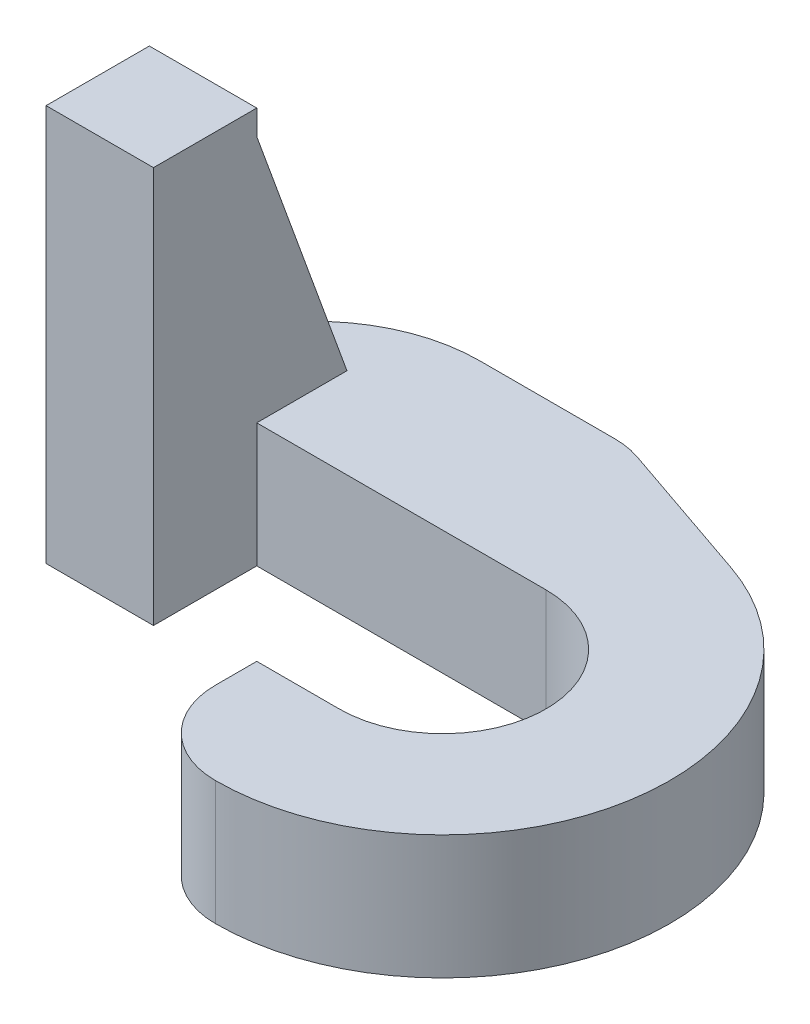
ISO-10303-21;
HEADER;
FILE_DESCRIPTION(('STEP AP214'),'2;1');
FILE_NAME('part.step','',(''),(''),'','','');
FILE_SCHEMA(('AUTOMOTIVE_DESIGN { 1 0 10303 214 1 1 1 1 }'));
ENDSEC;
DATA;
#1=APPLICATION_CONTEXT('core data for automotive mechanical design processes');
#2=APPLICATION_PROTOCOL_DEFINITION('international standard','automotive_design',2000,#1);
#3=PRODUCT_CONTEXT('',#1,'mechanical');
#4=PRODUCT('Part','Part','',(#3));
#5=PRODUCT_RELATED_PRODUCT_CATEGORY('part','',(#4));
#6=PRODUCT_DEFINITION_FORMATION('','',#4);
#7=PRODUCT_DEFINITION_CONTEXT('part definition',#1,'design');
#8=PRODUCT_DEFINITION('design','',#6,#7);
#9=PRODUCT_DEFINITION_SHAPE('','',#8);
#10=(LENGTH_UNIT() NAMED_UNIT(*) SI_UNIT(.MILLI.,.METRE.));
#11=(NAMED_UNIT(*) PLANE_ANGLE_UNIT() SI_UNIT($,.RADIAN.));
#12=(NAMED_UNIT(*) SI_UNIT($,.STERADIAN.) SOLID_ANGLE_UNIT());
#13=UNCERTAINTY_MEASURE_WITH_UNIT(LENGTH_MEASURE(1.E-05),#10,'distance_accuracy_value','');
#14=(GEOMETRIC_REPRESENTATION_CONTEXT(3) GLOBAL_UNCERTAINTY_ASSIGNED_CONTEXT((#13)) GLOBAL_UNIT_ASSIGNED_CONTEXT((#10,
#11,#12)) REPRESENTATION_CONTEXT('',''));
#15=CARTESIAN_POINT('',(0.,0.,0.));
#16=DIRECTION('',(0.,0.,1.));
#17=DIRECTION('',(1.,0.,0.));
#18=AXIS2_PLACEMENT_3D('',#15,#16,#17);
#19=CARTESIAN_POINT('',(9.6,0.,3.5));
#20=DIRECTION('',(0.,1.,0.));
#21=DIRECTION('',(0.,0.,-1.));
#22=AXIS2_PLACEMENT_3D('',#19,#20,#21);
#23=CYLINDRICAL_SURFACE('',#22,2.);
#24=CARTESIAN_POINT('',(9.6,0.,3.5));
#25=DIRECTION('',(0.,1.,0.));
#26=DIRECTION('',(0.,0.,-1.));
#27=AXIS2_PLACEMENT_3D('',#24,#25,#26);
#28=CIRCLE('',#27,2.);
#29=CARTESIAN_POINT('',(7.6,0.,3.5));
#30=VERTEX_POINT('',#29);
#31=CARTESIAN_POINT('',(9.6,0.,5.5));
#32=VERTEX_POINT('',#31);
#33=EDGE_CURVE('E200',#30,#32,#28,.T.);
#34=ORIENTED_EDGE('',*,*,#33,.T.);
#35=DIRECTION('',(0.,1.,0.));
#36=VECTOR('',#35,1.);
#37=CARTESIAN_POINT('',(9.6,0.,5.5));
#38=LINE('',#37,#36);
#39=CARTESIAN_POINT('',(9.6,3.,5.5));
#40=VERTEX_POINT('',#39);
#41=EDGE_CURVE('E92',#32,#40,#38,.T.);
#42=ORIENTED_EDGE('',*,*,#41,.T.);
#43=CARTESIAN_POINT('',(9.6,3.,3.5));
#44=DIRECTION('',(0.,-1.,0.));
#45=DIRECTION('',(0.,0.,1.));
#46=AXIS2_PLACEMENT_3D('',#43,#44,#45);
#47=CIRCLE('',#46,2.);
#48=CARTESIAN_POINT('',(7.6,3.,3.5));
#49=VERTEX_POINT('',#48);
#50=EDGE_CURVE('E271',#40,#49,#47,.T.);
#51=ORIENTED_EDGE('',*,*,#50,.T.);
#52=DIRECTION('',(0.,-1.,0.));
#53=VECTOR('',#52,1.);
#54=CARTESIAN_POINT('',(7.6,0.,3.5));
#55=LINE('',#54,#53);
#56=EDGE_CURVE('E9',#49,#30,#55,.T.);
#57=ORIENTED_EDGE('',*,*,#56,.T.);
#58=EDGE_LOOP('',(#34,#42,#51,#57));
#59=FACE_BOUND('',#58,.T.);
#60=ADVANCED_FACE('F14',(#59),#23,.T.);
#61=CARTESIAN_POINT('',(7.26666666666666,0.,-4.5));
#62=DIRECTION('',(0.,1.,0.));
#63=DIRECTION('',(0.,0.,-1.));
#64=AXIS2_PLACEMENT_3D('',#61,#62,#63);
#65=CYLINDRICAL_SURFACE('',#64,2.);
#66=CARTESIAN_POINT('',(7.26666666666666,0.,-4.5));
#67=DIRECTION('',(0.,1.,0.));
#68=DIRECTION('',(0.,0.,-1.));
#69=AXIS2_PLACEMENT_3D('',#66,#67,#68);
#70=CIRCLE('',#69,2.);
#71=CARTESIAN_POINT('',(7.91531531531532,0.,-6.39189189189189));
#72=VERTEX_POINT('',#71);
#73=CARTESIAN_POINT('',(7.26666666666666,0.,-6.5));
#74=VERTEX_POINT('',#73);
#75=EDGE_CURVE('E214',#72,#74,#70,.T.);
#76=ORIENTED_EDGE('',*,*,#75,.T.);
#77=DIRECTION('',(0.,1.,0.));
#78=VECTOR('',#77,1.);
#79=CARTESIAN_POINT('',(7.26666666666666,0.,-6.5));
#80=LINE('',#79,#78);
#81=CARTESIAN_POINT('',(7.26666666666666,3.,-6.5));
#82=VERTEX_POINT('',#81);
#83=EDGE_CURVE('E300',#74,#82,#80,.T.);
#84=ORIENTED_EDGE('',*,*,#83,.T.);
#85=CARTESIAN_POINT('',(7.26666666666666,3.,-4.5));
#86=DIRECTION('',(0.,-1.,0.));
#87=DIRECTION('',(0.,0.,1.));
#88=AXIS2_PLACEMENT_3D('',#85,#86,#87);
#89=CIRCLE('',#88,2.);
#90=CARTESIAN_POINT('',(7.91531531531532,3.,-6.39189189189189));
#91=VERTEX_POINT('',#90);
#92=EDGE_CURVE('E293',#82,#91,#89,.T.);
#93=ORIENTED_EDGE('',*,*,#92,.T.);
#94=DIRECTION('',(0.,-1.,0.));
#95=VECTOR('',#94,1.);
#96=CARTESIAN_POINT('',(7.91531531531532,0.,-6.39189189189189));
#97=LINE('',#96,#95);
#98=EDGE_CURVE('E40',#91,#72,#97,.T.);
#99=ORIENTED_EDGE('',*,*,#98,.T.);
#100=EDGE_LOOP('',(#76,#84,#93,#99));
#101=FACE_BOUND('',#100,.T.);
#102=ADVANCED_FACE('F527',(#101),#65,.T.);
#103=CARTESIAN_POINT('',(7.6,0.,0.));
#104=DIRECTION('',(1.,0.,0.));
#105=DIRECTION('',(0.,0.,1.));
#106=AXIS2_PLACEMENT_3D('',#103,#104,#105);
#107=PLANE('',#106);
#108=DIRECTION('',(0.,0.,1.));
#109=VECTOR('',#108,1.);
#110=CARTESIAN_POINT('',(7.6,3.,0.));
#111=LINE('',#110,#109);
#112=CARTESIAN_POINT('',(7.6,3.,2.5));
#113=VERTEX_POINT('',#112);
#114=EDGE_CURVE('E185',#113,#49,#111,.T.);
#115=ORIENTED_EDGE('',*,*,#114,.F.);
#116=DIRECTION('',(0.,1.,0.));
#117=VECTOR('',#116,1.);
#118=CARTESIAN_POINT('',(7.6,0.,2.5));
#119=LINE('',#118,#117);
#120=CARTESIAN_POINT('',(7.6,0.,2.5));
#121=VERTEX_POINT('',#120);
#122=EDGE_CURVE('E25',#121,#113,#119,.T.);
#123=ORIENTED_EDGE('',*,*,#122,.F.);
#124=DIRECTION('',(0.,0.,1.));
#125=VECTOR('',#124,1.);
#126=CARTESIAN_POINT('',(7.6,0.,0.));
#127=LINE('',#126,#125);
#128=EDGE_CURVE('E182',#121,#30,#127,.T.);
#129=ORIENTED_EDGE('',*,*,#128,.T.);
#130=ORIENTED_EDGE('',*,*,#56,.F.);
#131=EDGE_LOOP('',(#115,#123,#129,#130));
#132=FACE_BOUND('',#131,.T.);
#133=ADVANCED_FACE('F180',(#132),#107,.F.);
#134=CARTESIAN_POINT('',(0.,0.,2.5));
#135=DIRECTION('',(0.,0.,1.));
#136=DIRECTION('',(1.,0.,0.));
#137=AXIS2_PLACEMENT_3D('',#134,#135,#136);
#138=PLANE('',#137);
#139=DIRECTION('',(-1.,0.,0.));
#140=VECTOR('',#139,1.);
#141=CARTESIAN_POINT('',(0.,3.,2.5));
#142=LINE('',#141,#140);
#143=CARTESIAN_POINT('',(9.6,3.,2.5));
#144=VERTEX_POINT('',#143);
#145=EDGE_CURVE('E240',#144,#113,#142,.T.);
#146=ORIENTED_EDGE('',*,*,#145,.F.);
#147=DIRECTION('',(0.,1.,0.));
#148=VECTOR('',#147,1.);
#149=CARTESIAN_POINT('',(9.6,0.,2.5));
#150=LINE('',#149,#148);
#151=CARTESIAN_POINT('',(9.6,0.,2.5));
#152=VERTEX_POINT('',#151);
#153=EDGE_CURVE('E172',#152,#144,#150,.T.);
#154=ORIENTED_EDGE('',*,*,#153,.F.);
#155=DIRECTION('',(-1.,0.,0.));
#156=VECTOR('',#155,1.);
#157=CARTESIAN_POINT('',(0.,0.,2.5));
#158=LINE('',#157,#156);
#159=EDGE_CURVE('E190',#152,#121,#158,.T.);
#160=ORIENTED_EDGE('',*,*,#159,.T.);
#161=ORIENTED_EDGE('',*,*,#122,.T.);
#162=EDGE_LOOP('',(#146,#154,#160,#161));
#163=FACE_BOUND('',#162,.T.);
#164=ADVANCED_FACE('F191',(#163),#138,.F.);
#165=CARTESIAN_POINT('',(9.6,0.,0.));
#166=DIRECTION('',(0.,1.,0.));
#167=DIRECTION('',(0.,0.,-1.));
#168=AXIS2_PLACEMENT_3D('',#165,#166,#167);
#169=CYLINDRICAL_SURFACE('',#168,2.5);
#170=CARTESIAN_POINT('',(9.6,3.,0.));
#171=DIRECTION('',(0.,-1.,0.));
#172=DIRECTION('',(0.,0.,-1.));
#173=AXIS2_PLACEMENT_3D('',#170,#171,#172);
#174=CIRCLE('',#173,2.5);
#175=CARTESIAN_POINT('',(9.6,3.,-2.5));
#176=VERTEX_POINT('',#175);
#177=EDGE_CURVE('E230',#176,#144,#174,.T.);
#178=ORIENTED_EDGE('',*,*,#177,.F.);
#179=DIRECTION('',(0.,1.,0.));
#180=VECTOR('',#179,1.);
#181=CARTESIAN_POINT('',(9.6,0.,-2.5));
#182=LINE('',#181,#180);
#183=CARTESIAN_POINT('',(9.6,0.,-2.5));
#184=VERTEX_POINT('',#183);
#185=EDGE_CURVE('E164',#184,#176,#182,.T.);
#186=ORIENTED_EDGE('',*,*,#185,.F.);
#187=CARTESIAN_POINT('',(9.6,0.,0.));
#188=DIRECTION('',(0.,-1.,0.));
#189=DIRECTION('',(0.,0.,-1.));
#190=AXIS2_PLACEMENT_3D('',#187,#188,#189);
#191=CIRCLE('',#190,2.5);
#192=EDGE_CURVE('E195',#184,#152,#191,.T.);
#193=ORIENTED_EDGE('',*,*,#192,.T.);
#194=ORIENTED_EDGE('',*,*,#153,.T.);
#195=EDGE_LOOP('',(#178,#186,#193,#194));
#196=FACE_BOUND('',#195,.T.);
#197=ADVANCED_FACE('F16',(#196),#169,.F.);
#198=CARTESIAN_POINT('',(2.79357195032871,0.,-8.14791818845873));
#199=DIRECTION('',(0.324324324324324,0.,-0.945945945945946));
#200=DIRECTION('',(0.,-1.,0.));
#201=AXIS2_PLACEMENT_3D('',#198,#199,#200);
#202=PLANE('',#201);
#203=DIRECTION('',(0.945945945945946,0.,0.324324324324324));
#204=VECTOR('',#203,1.);
#205=CARTESIAN_POINT('',(2.79357195032871,3.,-8.14791818845873));
#206=LINE('',#205,#204);
#207=CARTESIAN_POINT('',(11.3837837837838,3.,-5.2027027027027));
#208=VERTEX_POINT('',#207);
#209=EDGE_CURVE('E270',#91,#208,#206,.T.);
#210=ORIENTED_EDGE('',*,*,#209,.T.);
#211=DIRECTION('',(0.,1.,0.));
#212=VECTOR('',#211,1.);
#213=CARTESIAN_POINT('',(11.3837837837838,0.,-5.2027027027027));
#214=LINE('',#213,#212);
#215=CARTESIAN_POINT('',(11.3837837837838,0.,-5.2027027027027));
#216=VERTEX_POINT('',#215);
#217=EDGE_CURVE('E104',#216,#208,#214,.T.);
#218=ORIENTED_EDGE('',*,*,#217,.F.);
#219=DIRECTION('',(0.945945945945946,0.,0.324324324324324));
#220=VECTOR('',#219,1.);
#221=CARTESIAN_POINT('',(2.79357195032871,0.,-8.14791818845873));
#222=LINE('',#221,#220);
#223=EDGE_CURVE('E280',#72,#216,#222,.T.);
#224=ORIENTED_EDGE('',*,*,#223,.F.);
#225=ORIENTED_EDGE('',*,*,#98,.F.);
#226=EDGE_LOOP('',(#210,#218,#224,#225));
#227=FACE_BOUND('',#226,.T.);
#228=ADVANCED_FACE('F512',(#227),#202,.T.);
#229=CARTESIAN_POINT('',(9.6,0.,0.));
#230=DIRECTION('',(0.,1.,0.));
#231=DIRECTION('',(0.,0.,-1.));
#232=AXIS2_PLACEMENT_3D('',#229,#230,#231);
#233=CYLINDRICAL_SURFACE('',#232,5.5);
#234=CARTESIAN_POINT('',(9.6,3.,0.));
#235=DIRECTION('',(0.,-1.,0.));
#236=DIRECTION('',(0.,0.,-1.));
#237=AXIS2_PLACEMENT_3D('',#234,#235,#236);
#238=CIRCLE('',#237,5.5);
#239=EDGE_CURVE('E268',#208,#40,#238,.T.);
#240=ORIENTED_EDGE('',*,*,#239,.T.);
#241=ORIENTED_EDGE('',*,*,#41,.F.);
#242=CARTESIAN_POINT('',(9.6,0.,0.));
#243=DIRECTION('',(0.,-1.,0.));
#244=DIRECTION('',(0.,0.,-1.));
#245=AXIS2_PLACEMENT_3D('',#242,#243,#244);
#246=CIRCLE('',#245,5.5);
#247=EDGE_CURVE('E208',#216,#32,#246,.T.);
#248=ORIENTED_EDGE('',*,*,#247,.F.);
#249=ORIENTED_EDGE('',*,*,#217,.T.);
#250=EDGE_LOOP('',(#240,#241,#248,#249));
#251=FACE_BOUND('',#250,.T.);
#252=ADVANCED_FACE('F516',(#251),#233,.T.);
#253=CARTESIAN_POINT('',(4.,0.,-2.5));
#254=DIRECTION('',(0.,1.,0.));
#255=DIRECTION('',(0.,0.,-1.));
#256=AXIS2_PLACEMENT_3D('',#253,#254,#255);
#257=CYLINDRICAL_SURFACE('',#256,4.);
#258=CARTESIAN_POINT('',(0.,9.,-2.5));
#259=CARTESIAN_POINT('',(0.,6.85439242775356,-3.28093729071387));
#260=CARTESIAN_POINT('',(0.222386019238584,4.79762064602606,-4.02954099794134));
#261=CARTESIAN_POINT('',(0.648742912211093,3.,-4.68382140559722));
#262=(BOUNDED_CURVE() B_SPLINE_CURVE(3,(#258,#259,#260,#261),.UNSPECIFIED.,.F.,
.F.) B_SPLINE_CURVE_WITH_KNOTS((4,4),(1.5707963267949,2.14832530863416),
.UNSPECIFIED.) CURVE() GEOMETRIC_REPRESENTATION_ITEM() RATIONAL_B_SPLINE_CURVE((1.,
0.972397627081488,0.972397627081488,1.)) REPRESENTATION_ITEM(''));
#263=CARTESIAN_POINT('',(0.,9.,-2.5));
#264=VERTEX_POINT('',#263);
#265=CARTESIAN_POINT('',(0.648742912211093,3.,-4.68382140559722));
#266=VERTEX_POINT('',#265);
#267=EDGE_CURVE('E221',#264,#266,#262,.T.);
#268=ORIENTED_EDGE('',*,*,#267,.T.);
#269=CARTESIAN_POINT('',(4.,3.,-2.5));
#270=DIRECTION('',(0.,-1.,0.));
#271=DIRECTION('',(0.,0.,1.));
#272=AXIS2_PLACEMENT_3D('',#269,#270,#271);
#273=CIRCLE('',#272,4.);
#274=CARTESIAN_POINT('',(4.,3.,-6.5));
#275=VERTEX_POINT('',#274);
#276=EDGE_CURVE('E231',#266,#275,#273,.T.);
#277=ORIENTED_EDGE('',*,*,#276,.T.);
#278=DIRECTION('',(0.,-1.,0.));
#279=VECTOR('',#278,1.);
#280=CARTESIAN_POINT('',(4.,0.,-6.5));
#281=LINE('',#280,#279);
#282=CARTESIAN_POINT('',(4.,0.,-6.5));
#283=VERTEX_POINT('',#282);
#284=EDGE_CURVE('E296',#275,#283,#281,.T.);
#285=ORIENTED_EDGE('',*,*,#284,.T.);
#286=CARTESIAN_POINT('',(4.,0.,-2.5));
#287=DIRECTION('',(0.,1.,0.));
#288=DIRECTION('',(0.,0.,-1.));
#289=AXIS2_PLACEMENT_3D('',#286,#287,#288);
#290=CIRCLE('',#289,4.);
#291=CARTESIAN_POINT('',(0.,0.,-2.5));
#292=VERTEX_POINT('',#291);
#293=EDGE_CURVE('E286',#283,#292,#290,.T.);
#294=ORIENTED_EDGE('',*,*,#293,.T.);
#295=DIRECTION('',(0.,1.,0.));
#296=VECTOR('',#295,1.);
#297=CARTESIAN_POINT('',(0.,3.,-2.5));
#298=LINE('',#297,#296);
#299=EDGE_CURVE('E308',#292,#264,#298,.T.);
#300=ORIENTED_EDGE('',*,*,#299,.T.);
#301=EDGE_LOOP('',(#268,#277,#285,#294,#300));
#302=FACE_BOUND('',#301,.T.);
#303=ADVANCED_FACE('F503',(#302),#257,.T.);
#304=CARTESIAN_POINT('',(0.,3.,-4.68382140559722));
#305=DIRECTION('',(0.,0.342020143325672,-0.939692620785907));
#306=DIRECTION('',(-1.,0.,0.));
#307=AXIS2_PLACEMENT_3D('',#304,#305,#306);
#308=PLANE('',#307);
#309=DIRECTION('',(1.,0.,0.));
#310=VECTOR('',#309,1.);
#311=CARTESIAN_POINT('',(2.6,9.,-2.5));
#312=LINE('',#311,#310);
#313=CARTESIAN_POINT('',(2.6,9.,-2.5));
#314=VERTEX_POINT('',#313);
#315=EDGE_CURVE('E291',#264,#314,#312,.T.);
#316=ORIENTED_EDGE('',*,*,#315,.T.);
#317=DIRECTION('',(0.,-0.939692620785907,-0.342020143325672));
#318=VECTOR('',#317,1.);
#319=CARTESIAN_POINT('',(2.6,1.05280000596461,-5.39254424358944));
#320=LINE('',#319,#318);
#321=CARTESIAN_POINT('',(2.6,3.,-4.68382140559722));
#322=VERTEX_POINT('',#321);
#323=EDGE_CURVE('E267',#314,#322,#320,.T.);
#324=ORIENTED_EDGE('',*,*,#323,.T.);
#325=DIRECTION('',(-1.,0.,0.));
#326=VECTOR('',#325,1.);
#327=CARTESIAN_POINT('',(0.,3.,-4.68382140559722));
#328=LINE('',#327,#326);
#329=EDGE_CURVE('E227',#322,#266,#328,.T.);
#330=ORIENTED_EDGE('',*,*,#329,.T.);
#331=ORIENTED_EDGE('',*,*,#267,.F.);
#332=EDGE_LOOP('',(#316,#324,#330,#331));
#333=FACE_BOUND('',#332,.T.);
#334=ADVANCED_FACE('F502',(#333),#308,.T.);
#335=CARTESIAN_POINT('',(0.,0.,-6.5));
#336=DIRECTION('',(0.,0.,-1.));
#337=DIRECTION('',(0.,-1.,0.));
#338=AXIS2_PLACEMENT_3D('',#335,#336,#337);
#339=PLANE('',#338);
#340=DIRECTION('',(1.,0.,0.));
#341=VECTOR('',#340,1.);
#342=CARTESIAN_POINT('',(0.,0.,-6.5));
#343=LINE('',#342,#341);
#344=EDGE_CURVE('E218',#283,#74,#343,.T.);
#345=ORIENTED_EDGE('',*,*,#344,.F.);
#346=ORIENTED_EDGE('',*,*,#284,.F.);
#347=DIRECTION('',(-1.,0.,0.));
#348=VECTOR('',#347,1.);
#349=CARTESIAN_POINT('',(0.,3.,-6.5));
#350=LINE('',#349,#348);
#351=EDGE_CURVE('E244',#82,#275,#350,.T.);
#352=ORIENTED_EDGE('',*,*,#351,.F.);
#353=ORIENTED_EDGE('',*,*,#83,.F.);
#354=EDGE_LOOP('',(#345,#346,#352,#353));
#355=FACE_BOUND('',#354,.T.);
#356=ADVANCED_FACE('F509',(#355),#339,.T.);
#357=CARTESIAN_POINT('',(0.,3.,-6.5));
#358=DIRECTION('',(0.,-1.,0.));
#359=DIRECTION('',(0.,0.,-1.));
#360=AXIS2_PLACEMENT_3D('',#357,#358,#359);
#361=PLANE('',#360);
#362=ORIENTED_EDGE('',*,*,#351,.T.);
#363=ORIENTED_EDGE('',*,*,#276,.F.);
#364=ORIENTED_EDGE('',*,*,#329,.F.);
#365=DIRECTION('',(0.,0.,-1.));
#366=VECTOR('',#365,1.);
#367=CARTESIAN_POINT('',(2.6,3.,-2.5));
#368=LINE('',#367,#366);
#369=CARTESIAN_POINT('',(2.6,3.,-2.5));
#370=VERTEX_POINT('',#369);
#371=EDGE_CURVE('E263',#370,#322,#368,.T.);
#372=ORIENTED_EDGE('',*,*,#371,.F.);
#373=DIRECTION('',(-1.,0.,0.));
#374=VECTOR('',#373,1.);
#375=CARTESIAN_POINT('',(0.,3.,-2.5));
#376=LINE('',#375,#374);
#377=EDGE_CURVE('E253',#176,#370,#376,.T.);
#378=ORIENTED_EDGE('',*,*,#377,.F.);
#379=ORIENTED_EDGE('',*,*,#177,.T.);
#380=ORIENTED_EDGE('',*,*,#145,.T.);
#381=ORIENTED_EDGE('',*,*,#114,.T.);
#382=ORIENTED_EDGE('',*,*,#50,.F.);
#383=ORIENTED_EDGE('',*,*,#239,.F.);
#384=ORIENTED_EDGE('',*,*,#209,.F.);
#385=ORIENTED_EDGE('',*,*,#92,.F.);
#386=EDGE_LOOP('',(#362,#363,#364,#372,#378,#379,#380,#381,#382,#383,#384,#385));
#387=FACE_BOUND('',#386,.T.);
#388=ADVANCED_FACE('F539',(#387),#361,.F.);
#389=CARTESIAN_POINT('',(0.,0.,-2.5));
#390=DIRECTION('',(0.,0.,-1.));
#391=DIRECTION('',(0.,-1.,0.));
#392=AXIS2_PLACEMENT_3D('',#389,#390,#391);
#393=PLANE('',#392);
#394=DIRECTION('',(1.,0.,0.));
#395=VECTOR('',#394,1.);
#396=CARTESIAN_POINT('',(0.,0.,-2.5));
#397=LINE('',#396,#395);
#398=CARTESIAN_POINT('',(2.6,0.,-2.5));
#399=VERTEX_POINT('',#398);
#400=EDGE_CURVE('E224',#399,#184,#397,.T.);
#401=ORIENTED_EDGE('',*,*,#400,.T.);
#402=ORIENTED_EDGE('',*,*,#185,.T.);
#403=ORIENTED_EDGE('',*,*,#377,.T.);
#404=DIRECTION('',(0.,1.,0.));
#405=VECTOR('',#404,1.);
#406=CARTESIAN_POINT('',(2.6,0.,-2.5));
#407=LINE('',#406,#405);
#408=EDGE_CURVE('E212',#399,#370,#407,.T.);
#409=ORIENTED_EDGE('',*,*,#408,.F.);
#410=EDGE_LOOP('',(#401,#402,#403,#409));
#411=FACE_BOUND('',#410,.T.);
#412=ADVANCED_FACE('F536',(#411),#393,.F.);
#413=CARTESIAN_POINT('',(0.,0.,0.));
#414=DIRECTION('',(0.,0.,1.));
#415=DIRECTION('',(1.,0.,0.));
#416=AXIS2_PLACEMENT_3D('',#413,#414,#415);
#417=PLANE('',#416);
#418=DIRECTION('',(0.,-1.,0.));
#419=VECTOR('',#418,1.);
#420=CARTESIAN_POINT('',(0.,0.,0.));
#421=LINE('',#420,#419);
#422=CARTESIAN_POINT('',(0.,9.6,0.));
#423=VERTEX_POINT('',#422);
#424=CARTESIAN_POINT('',(0.,0.,0.));
#425=VERTEX_POINT('',#424);
#426=EDGE_CURVE('E341',#423,#425,#421,.T.);
#427=ORIENTED_EDGE('',*,*,#426,.T.);
#428=DIRECTION('',(1.,0.,0.));
#429=VECTOR('',#428,1.);
#430=CARTESIAN_POINT('',(0.,0.,0.));
#431=LINE('',#430,#429);
#432=CARTESIAN_POINT('',(2.6,0.,0.));
#433=VERTEX_POINT('',#432);
#434=EDGE_CURVE('E262',#425,#433,#431,.T.);
#435=ORIENTED_EDGE('',*,*,#434,.T.);
#436=DIRECTION('',(0.,1.,0.));
#437=VECTOR('',#436,1.);
#438=CARTESIAN_POINT('',(2.6,0.,0.));
#439=LINE('',#438,#437);
#440=CARTESIAN_POINT('',(2.6,9.6,0.));
#441=VERTEX_POINT('',#440);
#442=EDGE_CURVE('E217',#433,#441,#439,.T.);
#443=ORIENTED_EDGE('',*,*,#442,.T.);
#444=DIRECTION('',(-1.,0.,0.));
#445=VECTOR('',#444,1.);
#446=CARTESIAN_POINT('',(0.,9.6,0.));
#447=LINE('',#446,#445);
#448=EDGE_CURVE('E18',#441,#423,#447,.T.);
#449=ORIENTED_EDGE('',*,*,#448,.T.);
#450=EDGE_LOOP('',(#427,#435,#443,#449));
#451=FACE_BOUND('',#450,.T.);
#452=ADVANCED_FACE('F355',(#451),#417,.T.);
#453=CARTESIAN_POINT('',(0.,9.6,-2.5));
#454=DIRECTION('',(0.,-1.,0.));
#455=DIRECTION('',(0.,0.,-1.));
#456=AXIS2_PLACEMENT_3D('',#453,#454,#455);
#457=PLANE('',#456);
#458=ORIENTED_EDGE('',*,*,#448,.F.);
#459=DIRECTION('',(0.,0.,1.));
#460=VECTOR('',#459,1.);
#461=CARTESIAN_POINT('',(2.6,9.6,-2.5));
#462=LINE('',#461,#460);
#463=CARTESIAN_POINT('',(2.6,9.6,-2.5));
#464=VERTEX_POINT('',#463);
#465=EDGE_CURVE('E275',#464,#441,#462,.T.);
#466=ORIENTED_EDGE('',*,*,#465,.F.);
#467=DIRECTION('',(-1.,0.,0.));
#468=VECTOR('',#467,1.);
#469=CARTESIAN_POINT('',(0.,9.6,-2.5));
#470=LINE('',#469,#468);
#471=CARTESIAN_POINT('',(0.,9.6,-2.5));
#472=VERTEX_POINT('',#471);
#473=EDGE_CURVE('E292',#464,#472,#470,.T.);
#474=ORIENTED_EDGE('',*,*,#473,.T.);
#475=DIRECTION('',(0.,0.,1.));
#476=VECTOR('',#475,1.);
#477=CARTESIAN_POINT('',(0.,9.6,-2.5));
#478=LINE('',#477,#476);
#479=EDGE_CURVE('E311',#472,#423,#478,.T.);
#480=ORIENTED_EDGE('',*,*,#479,.T.);
#481=EDGE_LOOP('',(#458,#466,#474,#480));
#482=FACE_BOUND('',#481,.T.);
#483=ADVANCED_FACE('F371',(#482),#457,.F.);
#484=CARTESIAN_POINT('',(2.6,0.,-2.5));
#485=DIRECTION('',(-1.,0.,0.));
#486=DIRECTION('',(0.,1.,0.));
#487=AXIS2_PLACEMENT_3D('',#484,#485,#486);
#488=PLANE('',#487);
#489=ORIENTED_EDGE('',*,*,#442,.F.);
#490=DIRECTION('',(0.,0.,1.));
#491=VECTOR('',#490,1.);
#492=CARTESIAN_POINT('',(2.6,0.,-2.5));
#493=LINE('',#492,#491);
#494=EDGE_CURVE('E259',#399,#433,#493,.T.);
#495=ORIENTED_EDGE('',*,*,#494,.F.);
#496=ORIENTED_EDGE('',*,*,#408,.T.);
#497=ORIENTED_EDGE('',*,*,#371,.T.);
#498=ORIENTED_EDGE('',*,*,#323,.F.);
#499=DIRECTION('',(0.,1.,0.));
#500=VECTOR('',#499,1.);
#501=CARTESIAN_POINT('',(2.6,0.,-2.5));
#502=LINE('',#501,#500);
#503=EDGE_CURVE('E287',#314,#464,#502,.T.);
#504=ORIENTED_EDGE('',*,*,#503,.T.);
#505=ORIENTED_EDGE('',*,*,#465,.T.);
#506=EDGE_LOOP('',(#489,#495,#496,#497,#498,#504,#505));
#507=FACE_BOUND('',#506,.T.);
#508=ADVANCED_FACE('F366',(#507),#488,.F.);
#509=CARTESIAN_POINT('',(0.,0.,-2.5));
#510=DIRECTION('',(0.,1.,0.));
#511=DIRECTION('',(1.,0.,0.));
#512=AXIS2_PLACEMENT_3D('',#509,#510,#511);
#513=PLANE('',#512);
#514=ORIENTED_EDGE('',*,*,#223,.T.);
#515=ORIENTED_EDGE('',*,*,#247,.T.);
#516=ORIENTED_EDGE('',*,*,#33,.F.);
#517=ORIENTED_EDGE('',*,*,#128,.F.);
#518=ORIENTED_EDGE('',*,*,#159,.F.);
#519=ORIENTED_EDGE('',*,*,#192,.F.);
#520=ORIENTED_EDGE('',*,*,#400,.F.);
#521=ORIENTED_EDGE('',*,*,#494,.T.);
#522=ORIENTED_EDGE('',*,*,#434,.F.);
#523=DIRECTION('',(0.,0.,1.));
#524=VECTOR('',#523,1.);
#525=CARTESIAN_POINT('',(0.,0.,-2.5));
#526=LINE('',#525,#524);
#527=EDGE_CURVE('E331',#292,#425,#526,.T.);
#528=ORIENTED_EDGE('',*,*,#527,.F.);
#529=ORIENTED_EDGE('',*,*,#293,.F.);
#530=ORIENTED_EDGE('',*,*,#344,.T.);
#531=ORIENTED_EDGE('',*,*,#75,.F.);
#532=EDGE_LOOP('',(#514,#515,#516,#517,#518,#519,#520,#521,#522,#528,#529,#530,#531));
#533=FACE_BOUND('',#532,.T.);
#534=ADVANCED_FACE('F198',(#533),#513,.F.);
#535=CARTESIAN_POINT('',(0.,0.,-2.5));
#536=DIRECTION('',(1.,0.,0.));
#537=DIRECTION('',(0.,1.,0.));
#538=AXIS2_PLACEMENT_3D('',#535,#536,#537);
#539=PLANE('',#538);
#540=ORIENTED_EDGE('',*,*,#527,.T.);
#541=ORIENTED_EDGE('',*,*,#426,.F.);
#542=ORIENTED_EDGE('',*,*,#479,.F.);
#543=DIRECTION('',(0.,-1.,0.));
#544=VECTOR('',#543,1.);
#545=CARTESIAN_POINT('',(0.,0.,-2.5));
#546=LINE('',#545,#544);
#547=EDGE_CURVE('E313',#472,#264,#546,.T.);
#548=ORIENTED_EDGE('',*,*,#547,.T.);
#549=ORIENTED_EDGE('',*,*,#299,.F.);
#550=EDGE_LOOP('',(#540,#541,#542,#548,#549));
#551=FACE_BOUND('',#550,.T.);
#552=ADVANCED_FACE('F360',(#551),#539,.F.);
#553=CARTESIAN_POINT('',(0.,0.,-2.5));
#554=DIRECTION('',(0.,0.,1.));
#555=DIRECTION('',(1.,0.,0.));
#556=AXIS2_PLACEMENT_3D('',#553,#554,#555);
#557=PLANE('',#556);
#558=ORIENTED_EDGE('',*,*,#547,.F.);
#559=ORIENTED_EDGE('',*,*,#473,.F.);
#560=ORIENTED_EDGE('',*,*,#503,.F.);
#561=ORIENTED_EDGE('',*,*,#315,.F.);
#562=EDGE_LOOP('',(#558,#559,#560,#561));
#563=FACE_BOUND('',#562,.T.);
#564=ADVANCED_FACE('F501',(#563),#557,.F.);
#565=CLOSED_SHELL('',(#60,#102,#133,#164,#197,#228,#252,#303,#334,#356,#388,#412,#452,#483,#508,
#534,#552,#564));
#566=MANIFOLD_SOLID_BREP('B1',#565);
#567=ADVANCED_BREP_SHAPE_REPRESENTATION('',(#18,#566),#14);
#568=SHAPE_DEFINITION_REPRESENTATION(#9,#567);
ENDSEC;
END-ISO-10303-21;
